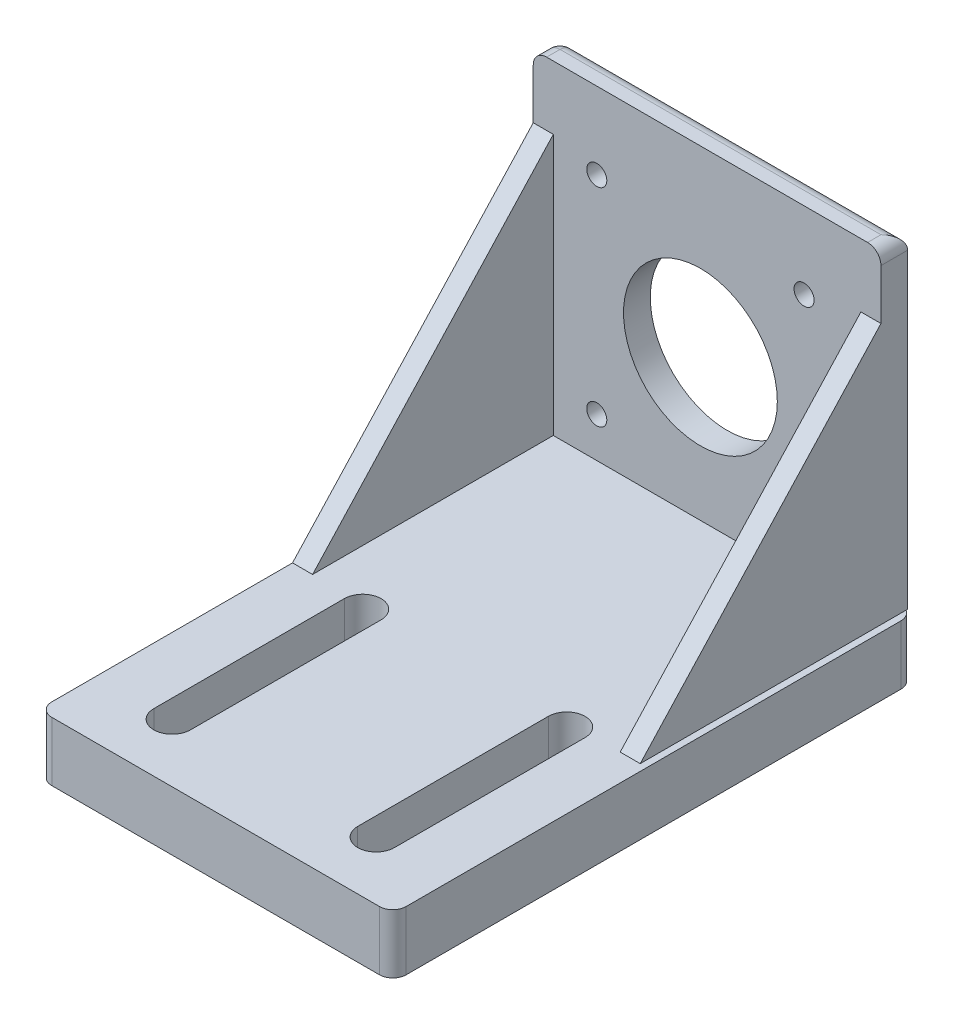
ISO-10303-21;
HEADER;
FILE_DESCRIPTION(('STEP AP214'),'2;1');
FILE_NAME('part.step','',(''),(''),'','','');
FILE_SCHEMA(('AUTOMOTIVE_DESIGN { 1 0 10303 214 1 1 1 1 }'));
ENDSEC;
DATA;
#1=APPLICATION_CONTEXT('core data for automotive mechanical design processes');
#2=APPLICATION_PROTOCOL_DEFINITION('international standard','automotive_design',2000,#1);
#3=PRODUCT_CONTEXT('',#1,'mechanical');
#4=PRODUCT('Part','Part','',(#3));
#5=PRODUCT_RELATED_PRODUCT_CATEGORY('part','',(#4));
#6=PRODUCT_DEFINITION_FORMATION('','',#4);
#7=PRODUCT_DEFINITION_CONTEXT('part definition',#1,'design');
#8=PRODUCT_DEFINITION('design','',#6,#7);
#9=PRODUCT_DEFINITION_SHAPE('','',#8);
#10=(LENGTH_UNIT() NAMED_UNIT(*) SI_UNIT(.MILLI.,.METRE.));
#11=(NAMED_UNIT(*) PLANE_ANGLE_UNIT() SI_UNIT($,.RADIAN.));
#12=(NAMED_UNIT(*) SI_UNIT($,.STERADIAN.) SOLID_ANGLE_UNIT());
#13=UNCERTAINTY_MEASURE_WITH_UNIT(LENGTH_MEASURE(1.E-05),#10,'distance_accuracy_value','');
#14=(GEOMETRIC_REPRESENTATION_CONTEXT(3) GLOBAL_UNCERTAINTY_ASSIGNED_CONTEXT((#13)) GLOBAL_UNIT_ASSIGNED_CONTEXT((#10,
#11,#12)) REPRESENTATION_CONTEXT('',''));
#15=CARTESIAN_POINT('',(0.,0.,0.));
#16=DIRECTION('',(0.,0.,1.));
#17=DIRECTION('',(1.,0.,0.));
#18=AXIS2_PLACEMENT_3D('',#15,#16,#17);
#19=CARTESIAN_POINT('',(0.,8.85,0.));
#20=DIRECTION('',(0.,-1.,0.));
#21=DIRECTION('',(0.,0.,-1.));
#22=AXIS2_PLACEMENT_3D('',#19,#20,#21);
#23=PLANE('',#22);
#24=DIRECTION('',(0.,0.,-1.));
#25=VECTOR('',#24,1.);
#26=CARTESIAN_POINT('',(2.49999999999999,8.85,16.75));
#27=LINE('',#26,#25);
#28=CARTESIAN_POINT('',(2.5,8.85,45.25));
#29=VERTEX_POINT('',#28);
#30=CARTESIAN_POINT('',(2.49999999999999,8.85,16.75));
#31=VERTEX_POINT('',#30);
#32=EDGE_CURVE('E264',#29,#31,#27,.T.);
#33=ORIENTED_EDGE('',*,*,#32,.F.);
#34=CARTESIAN_POINT('',(-0.249999999999997,8.85,45.25));
#35=DIRECTION('',(0.,1.,0.));
#36=DIRECTION('',(0.,0.,1.));
#37=AXIS2_PLACEMENT_3D('',#34,#35,#36);
#38=CIRCLE('',#37,2.75);
#39=CARTESIAN_POINT('',(-3.,8.85,45.2499999969299));
#40=VERTEX_POINT('',#39);
#41=EDGE_CURVE('E352',#40,#29,#38,.T.);
#42=ORIENTED_EDGE('',*,*,#41,.F.);
#43=DIRECTION('',(0.,0.,1.));
#44=VECTOR('',#43,1.);
#45=CARTESIAN_POINT('',(-3.,8.85,16.75));
#46=LINE('',#45,#44);
#47=CARTESIAN_POINT('',(-3.,8.85,16.75));
#48=VERTEX_POINT('',#47);
#49=EDGE_CURVE('E350',#48,#40,#46,.T.);
#50=ORIENTED_EDGE('',*,*,#49,.F.);
#51=CARTESIAN_POINT('',(-0.250000000000004,8.85,16.75));
#52=DIRECTION('',(0.,1.,0.));
#53=DIRECTION('',(0.,0.,1.));
#54=AXIS2_PLACEMENT_3D('',#51,#52,#53);
#55=CIRCLE('',#54,2.74999999999999);
#56=EDGE_CURVE('E348',#31,#48,#55,.T.);
#57=ORIENTED_EDGE('',*,*,#56,.F.);
#58=EDGE_LOOP('',(#33,#42,#50,#57));
#59=FACE_BOUND('',#58,.T.);
#60=DIRECTION('',(0.,0.,1.));
#61=VECTOR('',#60,1.);
#62=CARTESIAN_POINT('',(-33.5,8.85,16.75));
#63=LINE('',#62,#61);
#64=CARTESIAN_POINT('',(-33.5,8.85,16.75));
#65=VERTEX_POINT('',#64);
#66=CARTESIAN_POINT('',(-33.5,8.85,45.25));
#67=VERTEX_POINT('',#66);
#68=EDGE_CURVE('E355',#65,#67,#63,.T.);
#69=ORIENTED_EDGE('',*,*,#68,.F.);
#70=CARTESIAN_POINT('',(-30.75,8.85,16.75));
#71=DIRECTION('',(0.,1.,0.));
#72=DIRECTION('',(0.,0.,1.));
#73=AXIS2_PLACEMENT_3D('',#70,#71,#72);
#74=CIRCLE('',#73,2.74999999999999);
#75=CARTESIAN_POINT('',(-28.,8.85,16.75));
#76=VERTEX_POINT('',#75);
#77=EDGE_CURVE('E302',#76,#65,#74,.T.);
#78=ORIENTED_EDGE('',*,*,#77,.F.);
#79=DIRECTION('',(0.,0.,-1.));
#80=VECTOR('',#79,1.);
#81=CARTESIAN_POINT('',(-28.,8.85,16.75));
#82=LINE('',#81,#80);
#83=CARTESIAN_POINT('',(-28.,8.85,45.2499999969299));
#84=VERTEX_POINT('',#83);
#85=EDGE_CURVE('E359',#84,#76,#82,.T.);
#86=ORIENTED_EDGE('',*,*,#85,.F.);
#87=CARTESIAN_POINT('',(-30.75,8.85,45.25));
#88=DIRECTION('',(0.,1.,0.));
#89=DIRECTION('',(0.,0.,1.));
#90=AXIS2_PLACEMENT_3D('',#87,#88,#89);
#91=CIRCLE('',#90,2.75);
#92=EDGE_CURVE('E357',#67,#84,#91,.T.);
#93=ORIENTED_EDGE('',*,*,#92,.F.);
#94=EDGE_LOOP('',(#69,#78,#86,#93));
#95=FACE_BOUND('',#94,.T.);
#96=DIRECTION('',(0.,0.,-1.));
#97=VECTOR('',#96,1.);
#98=CARTESIAN_POINT('',(9.99999999999999,8.85,-20.));
#99=LINE('',#98,#97);
#100=CARTESIAN_POINT('',(9.99999999999999,8.85,16.));
#101=VERTEX_POINT('',#100);
#102=CARTESIAN_POINT('',(9.99999999999999,8.85,-23.7320508075689));
#103=VERTEX_POINT('',#102);
#104=EDGE_CURVE('E416',#101,#103,#99,.T.);
#105=ORIENTED_EDGE('',*,*,#104,.F.);
#106=DIRECTION('',(-1.,0.,0.));
#107=VECTOR('',#106,1.);
#108=CARTESIAN_POINT('',(0.,8.85,16.));
#109=LINE('',#108,#107);
#110=CARTESIAN_POINT('',(6.99999999999999,8.85,16.));
#111=VERTEX_POINT('',#110);
#112=EDGE_CURVE('E215',#101,#111,#109,.T.);
#113=ORIENTED_EDGE('',*,*,#112,.T.);
#114=DIRECTION('',(0.,0.,1.));
#115=VECTOR('',#114,1.);
#116=CARTESIAN_POINT('',(6.99999999999999,8.85,0.));
#117=LINE('',#116,#115);
#118=CARTESIAN_POINT('',(6.99999999999999,8.85,-20.));
#119=VERTEX_POINT('',#118);
#120=EDGE_CURVE('E404',#119,#111,#117,.T.);
#121=ORIENTED_EDGE('',*,*,#120,.F.);
#122=DIRECTION('',(1.,0.,0.));
#123=VECTOR('',#122,1.);
#124=CARTESIAN_POINT('',(-42.,8.85,-20.));
#125=LINE('',#124,#123);
#126=CARTESIAN_POINT('',(-39.,8.85,-20.));
#127=VERTEX_POINT('',#126);
#128=EDGE_CURVE('E390',#127,#119,#125,.T.);
#129=ORIENTED_EDGE('',*,*,#128,.F.);
#130=DIRECTION('',(0.,0.,-1.));
#131=VECTOR('',#130,1.);
#132=CARTESIAN_POINT('',(-39.,8.85,0.));
#133=LINE('',#132,#131);
#134=CARTESIAN_POINT('',(-39.,8.85,16.));
#135=VERTEX_POINT('',#134);
#136=EDGE_CURVE('E55',#135,#127,#133,.T.);
#137=ORIENTED_EDGE('',*,*,#136,.F.);
#138=DIRECTION('',(-1.,0.,0.));
#139=VECTOR('',#138,1.);
#140=CARTESIAN_POINT('',(0.,8.85,16.));
#141=LINE('',#140,#139);
#142=CARTESIAN_POINT('',(-42.,8.85,16.));
#143=VERTEX_POINT('',#142);
#144=EDGE_CURVE('E59',#135,#143,#141,.T.);
#145=ORIENTED_EDGE('',*,*,#144,.T.);
#146=DIRECTION('',(0.,0.,1.));
#147=VECTOR('',#146,1.);
#148=CARTESIAN_POINT('',(-42.,8.85,54.));
#149=LINE('',#148,#147);
#150=CARTESIAN_POINT('',(-42.,8.85,52.));
#151=VERTEX_POINT('',#150);
#152=EDGE_CURVE('E289',#143,#151,#149,.T.);
#153=ORIENTED_EDGE('',*,*,#152,.T.);
#154=CARTESIAN_POINT('',(-40.,8.85,52.));
#155=DIRECTION('',(0.,-1.,0.));
#156=DIRECTION('',(0.,0.,-1.));
#157=AXIS2_PLACEMENT_3D('',#154,#155,#156);
#158=CIRCLE('',#157,2.);
#159=CARTESIAN_POINT('',(-40.,8.85,54.));
#160=VERTEX_POINT('',#159);
#161=EDGE_CURVE('E328',#151,#160,#158,.F.);
#162=ORIENTED_EDGE('',*,*,#161,.T.);
#163=DIRECTION('',(1.,0.,0.));
#164=VECTOR('',#163,1.);
#165=CARTESIAN_POINT('',(-42.,8.85,54.));
#166=LINE('',#165,#164);
#167=CARTESIAN_POINT('',(8.99999999999999,8.85,54.));
#168=VERTEX_POINT('',#167);
#169=EDGE_CURVE('E291',#160,#168,#166,.T.);
#170=ORIENTED_EDGE('',*,*,#169,.T.);
#171=CARTESIAN_POINT('',(9.,8.85,52.));
#172=DIRECTION('',(0.,-1.,0.));
#173=DIRECTION('',(0.,0.,-1.));
#174=AXIS2_PLACEMENT_3D('',#171,#172,#173);
#175=CIRCLE('',#174,2.);
#176=CARTESIAN_POINT('',(11.,8.85,52.));
#177=VERTEX_POINT('',#176);
#178=EDGE_CURVE('E330',#168,#177,#175,.F.);
#179=ORIENTED_EDGE('',*,*,#178,.T.);
#180=DIRECTION('',(0.,0.,-1.));
#181=VECTOR('',#180,1.);
#182=CARTESIAN_POINT('',(11.,8.85,54.));
#183=LINE('',#182,#181);
#184=CARTESIAN_POINT('',(11.,8.85,-22.));
#185=VERTEX_POINT('',#184);
#186=EDGE_CURVE('E295',#177,#185,#183,.T.);
#187=ORIENTED_EDGE('',*,*,#186,.T.);
#188=CARTESIAN_POINT('',(8.99999999999999,8.85,-22.));
#189=DIRECTION('',(0.,-1.,0.));
#190=DIRECTION('',(0.,0.,-1.));
#191=AXIS2_PLACEMENT_3D('',#188,#189,#190);
#192=CIRCLE('',#191,2.);
#193=EDGE_CURVE('E333',#185,#103,#192,.F.);
#194=ORIENTED_EDGE('',*,*,#193,.T.);
#195=EDGE_LOOP('',(#105,#113,#121,#129,#137,#145,#153,#162,#170,#179,#187,#194));
#196=FACE_BOUND('',#195,.T.);
#197=ADVANCED_FACE('F40',(#59,#95,#196),#23,.F.);
#198=CARTESIAN_POINT('',(-42.,8.85,54.));
#199=DIRECTION('',(1.,0.,0.));
#200=DIRECTION('',(0.,0.,-1.));
#201=AXIS2_PLACEMENT_3D('',#198,#199,#200);
#202=PLANE('',#201);
#203=ORIENTED_EDGE('',*,*,#152,.F.);
#204=DIRECTION('',(0.,0.734803444627488,-0.678280102733066));
#205=VECTOR('',#204,1.);
#206=CARTESIAN_POINT('',(-42.,8.85000000000001,16.));
#207=LINE('',#206,#205);
#208=CARTESIAN_POINT('',(-42.,47.85,-20.));
#209=VERTEX_POINT('',#208);
#210=EDGE_CURVE('E403',#143,#209,#207,.T.);
#211=ORIENTED_EDGE('',*,*,#210,.T.);
#212=DIRECTION('',(0.,-1.,0.));
#213=VECTOR('',#212,1.);
#214=CARTESIAN_POINT('',(-42.,57.35,-20.));
#215=LINE('',#214,#213);
#216=CARTESIAN_POINT('',(-42.,55.35,-20.));
#217=VERTEX_POINT('',#216);
#218=EDGE_CURVE('E234',#217,#209,#215,.T.);
#219=ORIENTED_EDGE('',*,*,#218,.F.);
#220=DIRECTION('',(0.,0.,1.));
#221=VECTOR('',#220,1.);
#222=CARTESIAN_POINT('',(-42.,55.35,-22.));
#223=LINE('',#222,#221);
#224=CARTESIAN_POINT('',(-42.,55.35,-22.));
#225=VERTEX_POINT('',#224);
#226=EDGE_CURVE('E379',#217,#225,#223,.F.);
#227=ORIENTED_EDGE('',*,*,#226,.T.);
#228=DIRECTION('',(0.,-1.,0.));
#229=VECTOR('',#228,1.);
#230=CARTESIAN_POINT('',(-42.,8.85,-22.));
#231=LINE('',#230,#229);
#232=CARTESIAN_POINT('',(-42.,0.,-22.));
#233=VERTEX_POINT('',#232);
#234=EDGE_CURVE('E311',#225,#233,#231,.T.);
#235=ORIENTED_EDGE('',*,*,#234,.T.);
#236=DIRECTION('',(0.,0.,1.));
#237=VECTOR('',#236,1.);
#238=CARTESIAN_POINT('',(-42.,0.,54.));
#239=LINE('',#238,#237);
#240=CARTESIAN_POINT('',(-42.,0.,52.));
#241=VERTEX_POINT('',#240);
#242=EDGE_CURVE('E299',#233,#241,#239,.T.);
#243=ORIENTED_EDGE('',*,*,#242,.T.);
#244=DIRECTION('',(0.,-1.,0.));
#245=VECTOR('',#244,1.);
#246=CARTESIAN_POINT('',(-42.,8.85,52.));
#247=LINE('',#246,#245);
#248=EDGE_CURVE('E298',#241,#151,#247,.F.);
#249=ORIENTED_EDGE('',*,*,#248,.T.);
#250=EDGE_LOOP('',(#203,#211,#219,#227,#235,#243,#249));
#251=FACE_BOUND('',#250,.T.);
#252=ADVANCED_FACE('F455',(#251),#202,.F.);
#253=CARTESIAN_POINT('',(-42.,8.85,54.));
#254=DIRECTION('',(0.,0.,-1.));
#255=DIRECTION('',(-1.,0.,0.));
#256=AXIS2_PLACEMENT_3D('',#253,#254,#255);
#257=PLANE('',#256);
#258=DIRECTION('',(1.,0.,0.));
#259=VECTOR('',#258,1.);
#260=CARTESIAN_POINT('',(-42.,0.,54.));
#261=LINE('',#260,#259);
#262=CARTESIAN_POINT('',(-40.,0.,54.));
#263=VERTEX_POINT('',#262);
#264=CARTESIAN_POINT('',(8.99999999999999,0.,54.));
#265=VERTEX_POINT('',#264);
#266=EDGE_CURVE('E301',#263,#265,#261,.T.);
#267=ORIENTED_EDGE('',*,*,#266,.T.);
#268=DIRECTION('',(0.,-1.,0.));
#269=VECTOR('',#268,1.);
#270=CARTESIAN_POINT('',(8.99999999999999,8.85,54.));
#271=LINE('',#270,#269);
#272=EDGE_CURVE('E344',#265,#168,#271,.F.);
#273=ORIENTED_EDGE('',*,*,#272,.T.);
#274=ORIENTED_EDGE('',*,*,#169,.F.);
#275=DIRECTION('',(0.,-1.,0.));
#276=VECTOR('',#275,1.);
#277=CARTESIAN_POINT('',(-40.,8.85,54.));
#278=LINE('',#277,#276);
#279=EDGE_CURVE('E341',#160,#263,#278,.T.);
#280=ORIENTED_EDGE('',*,*,#279,.T.);
#281=EDGE_LOOP('',(#267,#273,#274,#280));
#282=FACE_BOUND('',#281,.T.);
#283=ADVANCED_FACE('F444',(#282),#257,.F.);
#284=CARTESIAN_POINT('',(11.,8.85,54.));
#285=DIRECTION('',(-1.,0.,0.));
#286=DIRECTION('',(0.,0.,1.));
#287=AXIS2_PLACEMENT_3D('',#284,#285,#286);
#288=PLANE('',#287);
#289=DIRECTION('',(0.,0.,-1.));
#290=VECTOR('',#289,1.);
#291=CARTESIAN_POINT('',(11.,0.,54.));
#292=LINE('',#291,#290);
#293=CARTESIAN_POINT('',(11.,0.,52.));
#294=VERTEX_POINT('',#293);
#295=CARTESIAN_POINT('',(11.,0.,-22.));
#296=VERTEX_POINT('',#295);
#297=EDGE_CURVE('E305',#294,#296,#292,.T.);
#298=ORIENTED_EDGE('',*,*,#297,.T.);
#299=DIRECTION('',(0.,-1.,0.));
#300=VECTOR('',#299,1.);
#301=CARTESIAN_POINT('',(11.,8.85,-22.));
#302=LINE('',#301,#300);
#303=EDGE_CURVE('E339',#296,#185,#302,.F.);
#304=ORIENTED_EDGE('',*,*,#303,.T.);
#305=ORIENTED_EDGE('',*,*,#186,.F.);
#306=DIRECTION('',(0.,-1.,0.));
#307=VECTOR('',#306,1.);
#308=CARTESIAN_POINT('',(11.,8.85,52.));
#309=LINE('',#308,#307);
#310=EDGE_CURVE('E336',#177,#294,#309,.T.);
#311=ORIENTED_EDGE('',*,*,#310,.T.);
#312=EDGE_LOOP('',(#298,#304,#305,#311));
#313=FACE_BOUND('',#312,.T.);
#314=ADVANCED_FACE('F434',(#313),#288,.F.);
#315=CARTESIAN_POINT('',(-42.,8.85,-24.));
#316=DIRECTION('',(0.,0.,1.));
#317=DIRECTION('',(1.,0.,0.));
#318=AXIS2_PLACEMENT_3D('',#315,#316,#317);
#319=PLANE('',#318);
#320=CARTESIAN_POINT('',(-1.5,45.85,-24.));
#321=DIRECTION('',(0.,0.,1.));
#322=DIRECTION('',(-1.,0.,0.));
#323=AXIS2_PLACEMENT_3D('',#320,#321,#322);
#324=CIRCLE('',#323,1.5);
#325=CARTESIAN_POINT('',(-3.00000000000001,45.85,-24.));
#326=VERTEX_POINT('',#325);
#327=EDGE_CURVE('E866',#326,#326,#324,.T.);
#328=ORIENTED_EDGE('',*,*,#327,.T.);
#329=EDGE_LOOP('',(#328));
#330=FACE_BOUND('',#329,.T.);
#331=CARTESIAN_POINT('',(-1.5,14.85,-24.));
#332=DIRECTION('',(0.,0.,1.));
#333=DIRECTION('',(-1.,0.,0.));
#334=AXIS2_PLACEMENT_3D('',#331,#332,#333);
#335=CIRCLE('',#334,1.5);
#336=CARTESIAN_POINT('',(-3.,14.85,-24.));
#337=VERTEX_POINT('',#336);
#338=EDGE_CURVE('E870',#337,#337,#335,.T.);
#339=ORIENTED_EDGE('',*,*,#338,.T.);
#340=EDGE_LOOP('',(#339));
#341=FACE_BOUND('',#340,.T.);
#342=CARTESIAN_POINT('',(-32.5,14.85,-24.));
#343=DIRECTION('',(0.,0.,1.));
#344=DIRECTION('',(1.,0.,0.));
#345=AXIS2_PLACEMENT_3D('',#342,#343,#344);
#346=CIRCLE('',#345,1.5);
#347=CARTESIAN_POINT('',(-31.,14.85,-24.));
#348=VERTEX_POINT('',#347);
#349=EDGE_CURVE('E900',#348,#348,#346,.T.);
#350=ORIENTED_EDGE('',*,*,#349,.T.);
#351=EDGE_LOOP('',(#350));
#352=FACE_BOUND('',#351,.T.);
#353=CARTESIAN_POINT('',(-32.5,45.85,-24.));
#354=DIRECTION('',(0.,0.,1.));
#355=DIRECTION('',(1.,0.,0.));
#356=AXIS2_PLACEMENT_3D('',#353,#354,#355);
#357=CIRCLE('',#356,1.5);
#358=CARTESIAN_POINT('',(-31.,45.85,-24.));
#359=VERTEX_POINT('',#358);
#360=EDGE_CURVE('E890',#359,#359,#357,.T.);
#361=ORIENTED_EDGE('',*,*,#360,.T.);
#362=EDGE_LOOP('',(#361));
#363=FACE_BOUND('',#362,.T.);
#364=CARTESIAN_POINT('',(-17.,30.,-24.));
#365=DIRECTION('',(0.,0.,1.));
#366=DIRECTION('',(1.,0.,0.));
#367=AXIS2_PLACEMENT_3D('',#364,#365,#366);
#368=CIRCLE('',#367,11.5);
#369=CARTESIAN_POINT('',(-5.5,30.,-24.));
#370=VERTEX_POINT('',#369);
#371=EDGE_CURVE('E878',#370,#370,#368,.T.);
#372=ORIENTED_EDGE('',*,*,#371,.T.);
#373=EDGE_LOOP('',(#372));
#374=FACE_BOUND('',#373,.T.);
#375=DIRECTION('',(0.,-1.,0.));
#376=VECTOR('',#375,1.);
#377=CARTESIAN_POINT('',(9.99999999999999,57.35,-24.));
#378=LINE('',#377,#376);
#379=CARTESIAN_POINT('',(9.99999999999999,55.35,-24.));
#380=VERTEX_POINT('',#379);
#381=CARTESIAN_POINT('',(9.99999999999999,8.85,-24.));
#382=VERTEX_POINT('',#381);
#383=EDGE_CURVE('E235',#380,#382,#378,.T.);
#384=ORIENTED_EDGE('',*,*,#383,.T.);
#385=DIRECTION('',(-1.,0.,0.));
#386=VECTOR('',#385,1.);
#387=CARTESIAN_POINT('',(-40.,8.85,-24.));
#388=LINE('',#387,#386);
#389=CARTESIAN_POINT('',(8.99999999999999,8.85,-24.));
#390=VERTEX_POINT('',#389);
#391=EDGE_CURVE('E413',#382,#390,#388,.T.);
#392=ORIENTED_EDGE('',*,*,#391,.T.);
#393=DIRECTION('',(0.,-1.,0.));
#394=VECTOR('',#393,1.);
#395=CARTESIAN_POINT('',(8.99999999999999,8.85,-24.));
#396=LINE('',#395,#394);
#397=CARTESIAN_POINT('',(8.99999999999999,0.,-24.));
#398=VERTEX_POINT('',#397);
#399=EDGE_CURVE('E323',#390,#398,#396,.T.);
#400=ORIENTED_EDGE('',*,*,#399,.T.);
#401=DIRECTION('',(-1.,0.,0.));
#402=VECTOR('',#401,1.);
#403=CARTESIAN_POINT('',(-42.,0.,-24.));
#404=LINE('',#403,#402);
#405=CARTESIAN_POINT('',(-40.,0.,-24.));
#406=VERTEX_POINT('',#405);
#407=EDGE_CURVE('E292',#398,#406,#404,.T.);
#408=ORIENTED_EDGE('',*,*,#407,.T.);
#409=DIRECTION('',(0.,-1.,0.));
#410=VECTOR('',#409,1.);
#411=CARTESIAN_POINT('',(-40.,8.85,-24.));
#412=LINE('',#411,#410);
#413=CARTESIAN_POINT('',(-40.,55.35,-24.));
#414=VERTEX_POINT('',#413);
#415=EDGE_CURVE('E326',#406,#414,#412,.F.);
#416=ORIENTED_EDGE('',*,*,#415,.T.);
#417=DIRECTION('',(-1.,0.,0.));
#418=VECTOR('',#417,1.);
#419=CARTESIAN_POINT('',(9.99999999999999,55.35,-24.));
#420=LINE('',#419,#418);
#421=EDGE_CURVE('E369',#414,#380,#420,.F.);
#422=ORIENTED_EDGE('',*,*,#421,.T.);
#423=EDGE_LOOP('',(#384,#392,#400,#408,#416,#422));
#424=FACE_BOUND('',#423,.T.);
#425=ADVANCED_FACE('F420',(#330,#341,#352,#363,#374,#424),#319,.F.);
#426=CARTESIAN_POINT('',(0.,0.,0.));
#427=DIRECTION('',(0.,-1.,0.));
#428=DIRECTION('',(0.,0.,-1.));
#429=AXIS2_PLACEMENT_3D('',#426,#427,#428);
#430=PLANE('',#429);
#431=CARTESIAN_POINT('',(8.99999999999999,0.,-22.));
#432=DIRECTION('',(0.,-1.,0.));
#433=DIRECTION('',(0.,0.,-1.));
#434=AXIS2_PLACEMENT_3D('',#431,#432,#433);
#435=CIRCLE('',#434,2.);
#436=EDGE_CURVE('E318',#398,#296,#435,.T.);
#437=ORIENTED_EDGE('',*,*,#436,.T.);
#438=ORIENTED_EDGE('',*,*,#297,.F.);
#439=CARTESIAN_POINT('',(9.,0.,52.));
#440=DIRECTION('',(0.,-1.,0.));
#441=DIRECTION('',(0.,0.,-1.));
#442=AXIS2_PLACEMENT_3D('',#439,#440,#441);
#443=CIRCLE('',#442,2.);
#444=EDGE_CURVE('E316',#294,#265,#443,.T.);
#445=ORIENTED_EDGE('',*,*,#444,.T.);
#446=ORIENTED_EDGE('',*,*,#266,.F.);
#447=CARTESIAN_POINT('',(-40.,0.,52.));
#448=DIRECTION('',(0.,-1.,0.));
#449=DIRECTION('',(0.,0.,-1.));
#450=AXIS2_PLACEMENT_3D('',#447,#448,#449);
#451=CIRCLE('',#450,2.);
#452=EDGE_CURVE('E313',#263,#241,#451,.T.);
#453=ORIENTED_EDGE('',*,*,#452,.T.);
#454=ORIENTED_EDGE('',*,*,#242,.F.);
#455=CARTESIAN_POINT('',(-40.,0.,-22.));
#456=DIRECTION('',(0.,-1.,0.));
#457=DIRECTION('',(0.,0.,-1.));
#458=AXIS2_PLACEMENT_3D('',#455,#456,#457);
#459=CIRCLE('',#458,2.);
#460=EDGE_CURVE('E320',#233,#406,#459,.T.);
#461=ORIENTED_EDGE('',*,*,#460,.T.);
#462=ORIENTED_EDGE('',*,*,#407,.F.);
#463=EDGE_LOOP('',(#437,#438,#445,#446,#453,#454,#461,#462));
#464=FACE_BOUND('',#463,.T.);
#465=CARTESIAN_POINT('',(-30.75,0.,16.75));
#466=DIRECTION('',(0.,1.,0.));
#467=DIRECTION('',(0.,0.,1.));
#468=AXIS2_PLACEMENT_3D('',#465,#466,#467);
#469=CIRCLE('',#468,2.74999999999999);
#470=CARTESIAN_POINT('',(-28.,0.,16.75));
#471=VERTEX_POINT('',#470);
#472=CARTESIAN_POINT('',(-33.5,0.,16.75));
#473=VERTEX_POINT('',#472);
#474=EDGE_CURVE('E243',#471,#473,#469,.T.);
#475=ORIENTED_EDGE('',*,*,#474,.T.);
#476=DIRECTION('',(0.,0.,1.));
#477=VECTOR('',#476,1.);
#478=CARTESIAN_POINT('',(-33.5,0.,16.75));
#479=LINE('',#478,#477);
#480=CARTESIAN_POINT('',(-33.5,0.,45.25));
#481=VERTEX_POINT('',#480);
#482=EDGE_CURVE('E246',#473,#481,#479,.T.);
#483=ORIENTED_EDGE('',*,*,#482,.T.);
#484=CARTESIAN_POINT('',(-30.75,0.,45.25));
#485=DIRECTION('',(0.,1.,0.));
#486=DIRECTION('',(0.,0.,1.));
#487=AXIS2_PLACEMENT_3D('',#484,#485,#486);
#488=CIRCLE('',#487,2.75);
#489=CARTESIAN_POINT('',(-28.,0.,45.2499999938597));
#490=VERTEX_POINT('',#489);
#491=EDGE_CURVE('E250',#481,#490,#488,.T.);
#492=ORIENTED_EDGE('',*,*,#491,.T.);
#493=DIRECTION('',(0.,0.,-1.));
#494=VECTOR('',#493,1.);
#495=CARTESIAN_POINT('',(-28.,0.,16.75));
#496=LINE('',#495,#494);
#497=EDGE_CURVE('E253',#490,#471,#496,.T.);
#498=ORIENTED_EDGE('',*,*,#497,.T.);
#499=EDGE_LOOP('',(#475,#483,#492,#498));
#500=FACE_BOUND('',#499,.T.);
#501=CARTESIAN_POINT('',(-0.249999999999997,0.,45.25));
#502=DIRECTION('',(0.,1.,0.));
#503=DIRECTION('',(0.,0.,-1.));
#504=AXIS2_PLACEMENT_3D('',#501,#502,#503);
#505=CIRCLE('',#504,2.75);
#506=CARTESIAN_POINT('',(-3.,0.,45.2499999938597));
#507=VERTEX_POINT('',#506);
#508=CARTESIAN_POINT('',(2.5,0.,45.25));
#509=VERTEX_POINT('',#508);
#510=EDGE_CURVE('E247',#507,#509,#505,.T.);
#511=ORIENTED_EDGE('',*,*,#510,.T.);
#512=DIRECTION('',(0.,0.,-1.));
#513=VECTOR('',#512,1.);
#514=CARTESIAN_POINT('',(2.49999999999999,0.,16.75));
#515=LINE('',#514,#513);
#516=CARTESIAN_POINT('',(2.49999999999999,0.,16.75));
#517=VERTEX_POINT('',#516);
#518=EDGE_CURVE('E284',#509,#517,#515,.T.);
#519=ORIENTED_EDGE('',*,*,#518,.T.);
#520=CARTESIAN_POINT('',(-0.250000000000004,0.,16.75));
#521=DIRECTION('',(0.,1.,0.));
#522=DIRECTION('',(0.,0.,-1.));
#523=AXIS2_PLACEMENT_3D('',#520,#521,#522);
#524=CIRCLE('',#523,2.74999999999999);
#525=CARTESIAN_POINT('',(-3.,0.,16.75));
#526=VERTEX_POINT('',#525);
#527=EDGE_CURVE('E281',#517,#526,#524,.T.);
#528=ORIENTED_EDGE('',*,*,#527,.T.);
#529=DIRECTION('',(0.,0.,1.));
#530=VECTOR('',#529,1.);
#531=CARTESIAN_POINT('',(-3.,0.,16.75));
#532=LINE('',#531,#530);
#533=EDGE_CURVE('E274',#526,#507,#532,.T.);
#534=ORIENTED_EDGE('',*,*,#533,.T.);
#535=EDGE_LOOP('',(#511,#519,#528,#534));
#536=FACE_BOUND('',#535,.T.);
#537=ADVANCED_FACE('F441',(#464,#500,#536),#430,.T.);
#538=CARTESIAN_POINT('',(-40.,8.85,-22.));
#539=DIRECTION('',(0.,-1.,0.));
#540=DIRECTION('',(0.,0.,-1.));
#541=AXIS2_PLACEMENT_3D('',#538,#539,#540);
#542=CYLINDRICAL_SURFACE('',#541,2.);
#543=CARTESIAN_POINT('',(-40.,55.35,-22.));
#544=DIRECTION('',(0.,-1.,0.));
#545=DIRECTION('',(0.,0.,-1.));
#546=AXIS2_PLACEMENT_3D('',#543,#544,#545);
#547=CIRCLE('',#546,2.);
#548=EDGE_CURVE('E371',#225,#414,#547,.T.);
#549=ORIENTED_EDGE('',*,*,#548,.T.);
#550=ORIENTED_EDGE('',*,*,#415,.F.);
#551=ORIENTED_EDGE('',*,*,#460,.F.);
#552=ORIENTED_EDGE('',*,*,#234,.F.);
#553=EDGE_LOOP('',(#549,#550,#551,#552));
#554=FACE_BOUND('',#553,.T.);
#555=ADVANCED_FACE('F460',(#554),#542,.T.);
#556=CARTESIAN_POINT('',(8.99999999999999,8.85,-22.));
#557=DIRECTION('',(0.,-1.,0.));
#558=DIRECTION('',(0.,0.,-1.));
#559=AXIS2_PLACEMENT_3D('',#556,#557,#558);
#560=CYLINDRICAL_SURFACE('',#559,2.);
#561=ORIENTED_EDGE('',*,*,#303,.F.);
#562=ORIENTED_EDGE('',*,*,#436,.F.);
#563=ORIENTED_EDGE('',*,*,#399,.F.);
#564=EDGE_CURVE('E332',#103,#390,#192,.F.);
#565=ORIENTED_EDGE('',*,*,#564,.F.);
#566=ORIENTED_EDGE('',*,*,#193,.F.);
#567=EDGE_LOOP('',(#561,#562,#563,#565,#566));
#568=FACE_BOUND('',#567,.T.);
#569=ADVANCED_FACE('F429',(#568),#560,.T.);
#570=CARTESIAN_POINT('',(9.,8.85,52.));
#571=DIRECTION('',(0.,-1.,0.));
#572=DIRECTION('',(0.,0.,-1.));
#573=AXIS2_PLACEMENT_3D('',#570,#571,#572);
#574=CYLINDRICAL_SURFACE('',#573,2.);
#575=ORIENTED_EDGE('',*,*,#178,.F.);
#576=ORIENTED_EDGE('',*,*,#272,.F.);
#577=ORIENTED_EDGE('',*,*,#444,.F.);
#578=ORIENTED_EDGE('',*,*,#310,.F.);
#579=EDGE_LOOP('',(#575,#576,#577,#578));
#580=FACE_BOUND('',#579,.T.);
#581=ADVANCED_FACE('F437',(#580),#574,.T.);
#582=CARTESIAN_POINT('',(-40.,8.85,52.));
#583=DIRECTION('',(0.,-1.,0.));
#584=DIRECTION('',(0.,0.,-1.));
#585=AXIS2_PLACEMENT_3D('',#582,#583,#584);
#586=CYLINDRICAL_SURFACE('',#585,2.);
#587=ORIENTED_EDGE('',*,*,#161,.F.);
#588=ORIENTED_EDGE('',*,*,#248,.F.);
#589=ORIENTED_EDGE('',*,*,#452,.F.);
#590=ORIENTED_EDGE('',*,*,#279,.F.);
#591=EDGE_LOOP('',(#587,#588,#589,#590));
#592=FACE_BOUND('',#591,.T.);
#593=ADVANCED_FACE('F449',(#592),#586,.T.);
#594=CARTESIAN_POINT('',(-0.249999999999997,0.,45.25));
#595=DIRECTION('',(0.,1.,0.));
#596=DIRECTION('',(0.,0.,1.));
#597=AXIS2_PLACEMENT_3D('',#594,#595,#596);
#598=CYLINDRICAL_SURFACE('',#597,2.75);
#599=DIRECTION('',(0.,1.,0.));
#600=VECTOR('',#599,1.);
#601=CARTESIAN_POINT('',(2.5,0.,45.25));
#602=LINE('',#601,#600);
#603=EDGE_CURVE('E271',#509,#29,#602,.T.);
#604=ORIENTED_EDGE('',*,*,#603,.F.);
#605=ORIENTED_EDGE('',*,*,#510,.F.);
#606=DIRECTION('',(0.,1.,0.));
#607=VECTOR('',#606,1.);
#608=CARTESIAN_POINT('',(-3.,0.,45.2499999938597));
#609=LINE('',#608,#607);
#610=EDGE_CURVE('E237',#507,#40,#609,.T.);
#611=ORIENTED_EDGE('',*,*,#610,.T.);
#612=ORIENTED_EDGE('',*,*,#41,.T.);
#613=EDGE_LOOP('',(#604,#605,#611,#612));
#614=FACE_BOUND('',#613,.T.);
#615=ADVANCED_FACE('F515',(#614),#598,.F.);
#616=CARTESIAN_POINT('',(-3.,0.,16.75));
#617=DIRECTION('',(-1.,0.,0.));
#618=DIRECTION('',(0.,0.,1.));
#619=AXIS2_PLACEMENT_3D('',#616,#617,#618);
#620=PLANE('',#619);
#621=ORIENTED_EDGE('',*,*,#610,.F.);
#622=ORIENTED_EDGE('',*,*,#533,.F.);
#623=DIRECTION('',(0.,1.,0.));
#624=VECTOR('',#623,1.);
#625=CARTESIAN_POINT('',(-3.,0.,16.75));
#626=LINE('',#625,#624);
#627=EDGE_CURVE('E272',#526,#48,#626,.T.);
#628=ORIENTED_EDGE('',*,*,#627,.T.);
#629=ORIENTED_EDGE('',*,*,#49,.T.);
#630=EDGE_LOOP('',(#621,#622,#628,#629));
#631=FACE_BOUND('',#630,.T.);
#632=ADVANCED_FACE('F497',(#631),#620,.F.);
#633=CARTESIAN_POINT('',(-0.250000000000004,0.,16.75));
#634=DIRECTION('',(0.,1.,0.));
#635=DIRECTION('',(0.,0.,1.));
#636=AXIS2_PLACEMENT_3D('',#633,#634,#635);
#637=CYLINDRICAL_SURFACE('',#636,2.74999999999999);
#638=ORIENTED_EDGE('',*,*,#627,.F.);
#639=ORIENTED_EDGE('',*,*,#527,.F.);
#640=DIRECTION('',(0.,1.,0.));
#641=VECTOR('',#640,1.);
#642=CARTESIAN_POINT('',(2.49999999999999,0.,16.75));
#643=LINE('',#642,#641);
#644=EDGE_CURVE('E268',#517,#31,#643,.T.);
#645=ORIENTED_EDGE('',*,*,#644,.T.);
#646=ORIENTED_EDGE('',*,*,#56,.T.);
#647=EDGE_LOOP('',(#638,#639,#645,#646));
#648=FACE_BOUND('',#647,.T.);
#649=ADVANCED_FACE('F524',(#648),#637,.F.);
#650=CARTESIAN_POINT('',(2.49999999999999,0.,16.75));
#651=DIRECTION('',(1.,0.,0.));
#652=DIRECTION('',(0.,0.,-1.));
#653=AXIS2_PLACEMENT_3D('',#650,#651,#652);
#654=PLANE('',#653);
#655=ORIENTED_EDGE('',*,*,#644,.F.);
#656=ORIENTED_EDGE('',*,*,#518,.F.);
#657=ORIENTED_EDGE('',*,*,#603,.T.);
#658=ORIENTED_EDGE('',*,*,#32,.T.);
#659=EDGE_LOOP('',(#655,#656,#657,#658));
#660=FACE_BOUND('',#659,.T.);
#661=ADVANCED_FACE('F530',(#660),#654,.F.);
#662=CARTESIAN_POINT('',(-30.75,0.,16.75));
#663=DIRECTION('',(0.,1.,0.));
#664=DIRECTION('',(0.,0.,1.));
#665=AXIS2_PLACEMENT_3D('',#662,#663,#664);
#666=CYLINDRICAL_SURFACE('',#665,2.74999999999999);
#667=DIRECTION('',(0.,1.,0.));
#668=VECTOR('',#667,1.);
#669=CARTESIAN_POINT('',(-33.5,0.,16.75));
#670=LINE('',#669,#668);
#671=EDGE_CURVE('E256',#473,#65,#670,.T.);
#672=ORIENTED_EDGE('',*,*,#671,.F.);
#673=ORIENTED_EDGE('',*,*,#474,.F.);
#674=DIRECTION('',(0.,1.,0.));
#675=VECTOR('',#674,1.);
#676=CARTESIAN_POINT('',(-28.,0.,16.75));
#677=LINE('',#676,#675);
#678=EDGE_CURVE('E260',#471,#76,#677,.T.);
#679=ORIENTED_EDGE('',*,*,#678,.T.);
#680=ORIENTED_EDGE('',*,*,#77,.T.);
#681=EDGE_LOOP('',(#672,#673,#679,#680));
#682=FACE_BOUND('',#681,.T.);
#683=ADVANCED_FACE('F528',(#682),#666,.F.);
#684=CARTESIAN_POINT('',(-28.,0.,16.75));
#685=DIRECTION('',(1.,0.,0.));
#686=DIRECTION('',(0.,0.,-1.));
#687=AXIS2_PLACEMENT_3D('',#684,#685,#686);
#688=PLANE('',#687);
#689=ORIENTED_EDGE('',*,*,#678,.F.);
#690=ORIENTED_EDGE('',*,*,#497,.F.);
#691=DIRECTION('',(0.,1.,0.));
#692=VECTOR('',#691,1.);
#693=CARTESIAN_POINT('',(-28.,0.,45.2499999938597));
#694=LINE('',#693,#692);
#695=EDGE_CURVE('E257',#490,#84,#694,.T.);
#696=ORIENTED_EDGE('',*,*,#695,.T.);
#697=ORIENTED_EDGE('',*,*,#85,.T.);
#698=EDGE_LOOP('',(#689,#690,#696,#697));
#699=FACE_BOUND('',#698,.T.);
#700=ADVANCED_FACE('F557',(#699),#688,.F.);
#701=CARTESIAN_POINT('',(-30.75,0.,45.25));
#702=DIRECTION('',(0.,1.,0.));
#703=DIRECTION('',(0.,0.,1.));
#704=AXIS2_PLACEMENT_3D('',#701,#702,#703);
#705=CYLINDRICAL_SURFACE('',#704,2.75);
#706=ORIENTED_EDGE('',*,*,#695,.F.);
#707=ORIENTED_EDGE('',*,*,#491,.F.);
#708=DIRECTION('',(0.,1.,0.));
#709=VECTOR('',#708,1.);
#710=CARTESIAN_POINT('',(-33.5,0.,45.25));
#711=LINE('',#710,#709);
#712=EDGE_CURVE('E261',#481,#67,#711,.T.);
#713=ORIENTED_EDGE('',*,*,#712,.T.);
#714=ORIENTED_EDGE('',*,*,#92,.T.);
#715=EDGE_LOOP('',(#706,#707,#713,#714));
#716=FACE_BOUND('',#715,.T.);
#717=ADVANCED_FACE('F564',(#716),#705,.F.);
#718=CARTESIAN_POINT('',(-33.5,0.,16.75));
#719=DIRECTION('',(-1.,0.,0.));
#720=DIRECTION('',(0.,0.,1.));
#721=AXIS2_PLACEMENT_3D('',#718,#719,#720);
#722=PLANE('',#721);
#723=ORIENTED_EDGE('',*,*,#712,.F.);
#724=ORIENTED_EDGE('',*,*,#482,.F.);
#725=ORIENTED_EDGE('',*,*,#671,.T.);
#726=ORIENTED_EDGE('',*,*,#68,.T.);
#727=EDGE_LOOP('',(#723,#724,#725,#726));
#728=FACE_BOUND('',#727,.T.);
#729=ADVANCED_FACE('F572',(#728),#722,.F.);
#730=CARTESIAN_POINT('',(-40.,8.85,-22.));
#731=DIRECTION('',(0.,1.,0.));
#732=DIRECTION('',(0.,0.,1.));
#733=AXIS2_PLACEMENT_3D('',#730,#731,#732);
#734=PLANE('',#733);
#735=EDGE_CURVE('E415',#103,#382,#99,.T.);
#736=ORIENTED_EDGE('',*,*,#735,.F.);
#737=ORIENTED_EDGE('',*,*,#564,.T.);
#738=ORIENTED_EDGE('',*,*,#391,.F.);
#739=EDGE_LOOP('',(#736,#737,#738));
#740=FACE_BOUND('',#739,.T.);
#741=ADVANCED_FACE('F425',(#740),#734,.F.);
#742=CARTESIAN_POINT('',(-42.,57.35,-20.));
#743=DIRECTION('',(0.,0.,-1.));
#744=DIRECTION('',(-1.,0.,0.));
#745=AXIS2_PLACEMENT_3D('',#742,#743,#744);
#746=PLANE('',#745);
#747=CARTESIAN_POINT('',(-1.5,45.85,-20.));
#748=DIRECTION('',(0.,0.,1.));
#749=DIRECTION('',(-1.,0.,0.));
#750=AXIS2_PLACEMENT_3D('',#747,#748,#749);
#751=CIRCLE('',#750,1.5);
#752=CARTESIAN_POINT('',(-3.00000000000001,45.85,-20.));
#753=VERTEX_POINT('',#752);
#754=EDGE_CURVE('E869',#753,#753,#751,.T.);
#755=ORIENTED_EDGE('',*,*,#754,.F.);
#756=EDGE_LOOP('',(#755));
#757=FACE_BOUND('',#756,.T.);
#758=CARTESIAN_POINT('',(-1.5,14.85,-20.));
#759=DIRECTION('',(0.,0.,1.));
#760=DIRECTION('',(-1.,0.,0.));
#761=AXIS2_PLACEMENT_3D('',#758,#759,#760);
#762=CIRCLE('',#761,1.5);
#763=CARTESIAN_POINT('',(-3.,14.85,-20.));
#764=VERTEX_POINT('',#763);
#765=EDGE_CURVE('E873',#764,#764,#762,.T.);
#766=ORIENTED_EDGE('',*,*,#765,.F.);
#767=EDGE_LOOP('',(#766));
#768=FACE_BOUND('',#767,.T.);
#769=CARTESIAN_POINT('',(-32.5,14.85,-20.));
#770=DIRECTION('',(0.,0.,1.));
#771=DIRECTION('',(1.,0.,0.));
#772=AXIS2_PLACEMENT_3D('',#769,#770,#771);
#773=CIRCLE('',#772,1.5);
#774=CARTESIAN_POINT('',(-31.,14.85,-20.));
#775=VERTEX_POINT('',#774);
#776=EDGE_CURVE('E895',#775,#775,#773,.T.);
#777=ORIENTED_EDGE('',*,*,#776,.F.);
#778=EDGE_LOOP('',(#777));
#779=FACE_BOUND('',#778,.T.);
#780=CARTESIAN_POINT('',(-32.5,45.85,-20.));
#781=DIRECTION('',(0.,0.,1.));
#782=DIRECTION('',(1.,0.,0.));
#783=AXIS2_PLACEMENT_3D('',#780,#781,#782);
#784=CIRCLE('',#783,1.5);
#785=CARTESIAN_POINT('',(-31.,45.85,-20.));
#786=VERTEX_POINT('',#785);
#787=EDGE_CURVE('E883',#786,#786,#784,.T.);
#788=ORIENTED_EDGE('',*,*,#787,.F.);
#789=EDGE_LOOP('',(#788));
#790=FACE_BOUND('',#789,.T.);
#791=CARTESIAN_POINT('',(-17.,30.,-20.));
#792=DIRECTION('',(0.,0.,1.));
#793=DIRECTION('',(1.,0.,0.));
#794=AXIS2_PLACEMENT_3D('',#791,#792,#793);
#795=CIRCLE('',#794,11.5);
#796=CARTESIAN_POINT('',(-5.5,30.,-20.));
#797=VERTEX_POINT('',#796);
#798=EDGE_CURVE('E881',#797,#797,#795,.T.);
#799=ORIENTED_EDGE('',*,*,#798,.F.);
#800=EDGE_LOOP('',(#799));
#801=FACE_BOUND('',#800,.T.);
#802=DIRECTION('',(0.,-1.,0.));
#803=VECTOR('',#802,1.);
#804=CARTESIAN_POINT('',(6.99999999999999,57.35,-20.));
#805=LINE('',#804,#803);
#806=CARTESIAN_POINT('',(6.99999999999999,47.85,-20.));
#807=VERTEX_POINT('',#806);
#808=EDGE_CURVE('E11',#807,#119,#805,.T.);
#809=ORIENTED_EDGE('',*,*,#808,.F.);
#810=DIRECTION('',(1.,0.,0.));
#811=VECTOR('',#810,1.);
#812=CARTESIAN_POINT('',(-42.,47.85,-20.));
#813=LINE('',#812,#811);
#814=CARTESIAN_POINT('',(9.99999999999999,47.85,-20.));
#815=VERTEX_POINT('',#814);
#816=EDGE_CURVE('E212',#807,#815,#813,.T.);
#817=ORIENTED_EDGE('',*,*,#816,.T.);
#818=DIRECTION('',(0.,-1.,0.));
#819=VECTOR('',#818,1.);
#820=CARTESIAN_POINT('',(9.99999999999999,57.35,-20.));
#821=LINE('',#820,#819);
#822=CARTESIAN_POINT('',(9.99999999999999,55.35,-20.));
#823=VERTEX_POINT('',#822);
#824=EDGE_CURVE('E225',#823,#815,#821,.T.);
#825=ORIENTED_EDGE('',*,*,#824,.F.);
#826=CARTESIAN_POINT('',(7.99999999999999,55.35,-20.));
#827=DIRECTION('',(0.,0.,-1.));
#828=DIRECTION('',(-1.,0.,0.));
#829=AXIS2_PLACEMENT_3D('',#826,#827,#828);
#830=CIRCLE('',#829,2.);
#831=CARTESIAN_POINT('',(7.99999999999998,57.35,-20.));
#832=VERTEX_POINT('',#831);
#833=EDGE_CURVE('E377',#823,#832,#830,.F.);
#834=ORIENTED_EDGE('',*,*,#833,.T.);
#835=DIRECTION('',(1.,0.,0.));
#836=VECTOR('',#835,1.);
#837=CARTESIAN_POINT('',(-42.,57.35,-20.));
#838=LINE('',#837,#836);
#839=CARTESIAN_POINT('',(-40.,57.35,-20.));
#840=VERTEX_POINT('',#839);
#841=EDGE_CURVE('E239',#840,#832,#838,.T.);
#842=ORIENTED_EDGE('',*,*,#841,.F.);
#843=CARTESIAN_POINT('',(-40.,55.35,-20.));
#844=DIRECTION('',(0.,0.,-1.));
#845=DIRECTION('',(-1.,0.,0.));
#846=AXIS2_PLACEMENT_3D('',#843,#844,#845);
#847=CIRCLE('',#846,2.);
#848=EDGE_CURVE('E375',#840,#217,#847,.F.);
#849=ORIENTED_EDGE('',*,*,#848,.T.);
#850=ORIENTED_EDGE('',*,*,#218,.T.);
#851=DIRECTION('',(1.,0.,0.));
#852=VECTOR('',#851,1.);
#853=CARTESIAN_POINT('',(-42.,47.85,-20.));
#854=LINE('',#853,#852);
#855=CARTESIAN_POINT('',(-39.,47.85,-20.));
#856=VERTEX_POINT('',#855);
#857=EDGE_CURVE('E48',#209,#856,#854,.T.);
#858=ORIENTED_EDGE('',*,*,#857,.T.);
#859=DIRECTION('',(0.,1.,0.));
#860=VECTOR('',#859,1.);
#861=CARTESIAN_POINT('',(-39.,57.35,-20.));
#862=LINE('',#861,#860);
#863=EDGE_CURVE('E381',#127,#856,#862,.T.);
#864=ORIENTED_EDGE('',*,*,#863,.F.);
#865=ORIENTED_EDGE('',*,*,#128,.T.);
#866=EDGE_LOOP('',(#809,#817,#825,#834,#842,#849,#850,#858,#864,#865));
#867=FACE_BOUND('',#866,.T.);
#868=ADVANCED_FACE('F224',(#757,#768,#779,#790,#801,#867),#746,.F.);
#869=CARTESIAN_POINT('',(9.99999999999999,57.35,-20.));
#870=DIRECTION('',(-1.,0.,0.));
#871=DIRECTION('',(0.,0.,1.));
#872=AXIS2_PLACEMENT_3D('',#869,#870,#871);
#873=PLANE('',#872);
#874=ORIENTED_EDGE('',*,*,#735,.T.);
#875=ORIENTED_EDGE('',*,*,#383,.F.);
#876=DIRECTION('',(0.,0.,-1.));
#877=VECTOR('',#876,1.);
#878=CARTESIAN_POINT('',(9.99999999999999,55.35,-20.));
#879=LINE('',#878,#877);
#880=EDGE_CURVE('E233',#380,#823,#879,.F.);
#881=ORIENTED_EDGE('',*,*,#880,.T.);
#882=ORIENTED_EDGE('',*,*,#824,.T.);
#883=DIRECTION('',(0.,-0.734803444627488,0.678280102733066));
#884=VECTOR('',#883,1.);
#885=CARTESIAN_POINT('',(9.99999999999999,47.85,-20.));
#886=LINE('',#885,#884);
#887=EDGE_CURVE('E208',#815,#101,#886,.T.);
#888=ORIENTED_EDGE('',*,*,#887,.T.);
#889=ORIENTED_EDGE('',*,*,#104,.T.);
#890=EDGE_LOOP('',(#874,#875,#881,#882,#888,#889));
#891=FACE_BOUND('',#890,.T.);
#892=ADVANCED_FACE('F230',(#891),#873,.F.);
#893=CARTESIAN_POINT('',(-40.,57.35,-22.));
#894=DIRECTION('',(0.,1.,0.));
#895=DIRECTION('',(0.,0.,1.));
#896=AXIS2_PLACEMENT_3D('',#893,#894,#895);
#897=PLANE('',#896);
#898=ORIENTED_EDGE('',*,*,#841,.T.);
#899=DIRECTION('',(0.,0.,-1.));
#900=VECTOR('',#899,1.);
#901=CARTESIAN_POINT('',(7.99999999999999,57.35,-24.));
#902=LINE('',#901,#900);
#903=CARTESIAN_POINT('',(7.99999999999999,57.35,-22.));
#904=VERTEX_POINT('',#903);
#905=EDGE_CURVE('E367',#832,#904,#902,.T.);
#906=ORIENTED_EDGE('',*,*,#905,.T.);
#907=DIRECTION('',(-1.,0.,0.));
#908=VECTOR('',#907,1.);
#909=CARTESIAN_POINT('',(-40.,57.35,-22.));
#910=LINE('',#909,#908);
#911=CARTESIAN_POINT('',(-40.,57.35,-22.));
#912=VERTEX_POINT('',#911);
#913=EDGE_CURVE('E364',#904,#912,#910,.T.);
#914=ORIENTED_EDGE('',*,*,#913,.T.);
#915=DIRECTION('',(0.,0.,1.));
#916=VECTOR('',#915,1.);
#917=CARTESIAN_POINT('',(-40.,57.35,-20.));
#918=LINE('',#917,#916);
#919=EDGE_CURVE('E346',#912,#840,#918,.T.);
#920=ORIENTED_EDGE('',*,*,#919,.T.);
#921=EDGE_LOOP('',(#898,#906,#914,#920));
#922=FACE_BOUND('',#921,.T.);
#923=ADVANCED_FACE('F472',(#922),#897,.T.);
#924=CARTESIAN_POINT('',(-40.,55.35,-22.));
#925=DIRECTION('',(0.,0.,-1.));
#926=DIRECTION('',(-1.,0.,0.));
#927=AXIS2_PLACEMENT_3D('',#924,#925,#926);
#928=CYLINDRICAL_SURFACE('',#927,2.);
#929=ORIENTED_EDGE('',*,*,#848,.F.);
#930=ORIENTED_EDGE('',*,*,#919,.F.);
#931=CARTESIAN_POINT('',(-40.,55.35,-22.));
#932=DIRECTION('',(0.,0.,-1.));
#933=DIRECTION('',(-1.,0.,0.));
#934=AXIS2_PLACEMENT_3D('',#931,#932,#933);
#935=CIRCLE('',#934,2.);
#936=EDGE_CURVE('E387',#225,#912,#935,.T.);
#937=ORIENTED_EDGE('',*,*,#936,.F.);
#938=ORIENTED_EDGE('',*,*,#226,.F.);
#939=EDGE_LOOP('',(#929,#930,#937,#938));
#940=FACE_BOUND('',#939,.T.);
#941=ADVANCED_FACE('F42',(#940),#928,.T.);
#942=CARTESIAN_POINT('',(7.99999999999999,55.35,-22.));
#943=DIRECTION('',(0.,0.,1.));
#944=DIRECTION('',(1.,0.,0.));
#945=AXIS2_PLACEMENT_3D('',#942,#943,#944);
#946=CYLINDRICAL_SURFACE('',#945,2.);
#947=ORIENTED_EDGE('',*,*,#833,.F.);
#948=ORIENTED_EDGE('',*,*,#880,.F.);
#949=CARTESIAN_POINT('',(7.99999999999999,55.35,-22.));
#950=DIRECTION('',(0.707106781186547,0.,0.707106781186547));
#951=DIRECTION('',(-0.707106781186547,0.,0.707106781186547));
#952=AXIS2_PLACEMENT_3D('',#949,#950,#951);
#953=ELLIPSE('',#952,2.82842712474619,2.);
#954=EDGE_CURVE('E384',#904,#380,#953,.F.);
#955=ORIENTED_EDGE('',*,*,#954,.F.);
#956=ORIENTED_EDGE('',*,*,#905,.F.);
#957=EDGE_LOOP('',(#947,#948,#955,#956));
#958=FACE_BOUND('',#957,.T.);
#959=ADVANCED_FACE('F467',(#958),#946,.T.);
#960=CARTESIAN_POINT('',(-40.,55.35,-22.));
#961=DIRECTION('',(0.,1.,0.));
#962=DIRECTION('',(0.,0.,1.));
#963=AXIS2_PLACEMENT_3D('',#960,#961,#962);
#964=SPHERICAL_SURFACE('',#963,2.);
#965=ORIENTED_EDGE('',*,*,#548,.F.);
#966=ORIENTED_EDGE('',*,*,#936,.T.);
#967=CARTESIAN_POINT('',(-40.,55.35,-22.));
#968=DIRECTION('',(1.,0.,0.));
#969=DIRECTION('',(0.,0.,-1.));
#970=AXIS2_PLACEMENT_3D('',#967,#968,#969);
#971=CIRCLE('',#970,2.);
#972=EDGE_CURVE('E382',#414,#912,#971,.T.);
#973=ORIENTED_EDGE('',*,*,#972,.F.);
#974=EDGE_LOOP('',(#965,#966,#973));
#975=FACE_BOUND('',#974,.T.);
#976=ADVANCED_FACE('F478',(#975),#964,.T.);
#977=CARTESIAN_POINT('',(-40.,55.35,-22.));
#978=DIRECTION('',(1.,0.,0.));
#979=DIRECTION('',(0.,0.,-1.));
#980=AXIS2_PLACEMENT_3D('',#977,#978,#979);
#981=CYLINDRICAL_SURFACE('',#980,2.);
#982=ORIENTED_EDGE('',*,*,#954,.T.);
#983=ORIENTED_EDGE('',*,*,#421,.F.);
#984=ORIENTED_EDGE('',*,*,#972,.T.);
#985=ORIENTED_EDGE('',*,*,#913,.F.);
#986=EDGE_LOOP('',(#982,#983,#984,#985));
#987=FACE_BOUND('',#986,.T.);
#988=ADVANCED_FACE('F470',(#987),#981,.T.);
#989=CARTESIAN_POINT('',(-42.,8.85000000000001,16.));
#990=DIRECTION('',(0.,0.678280102733066,0.734803444627488));
#991=DIRECTION('',(0.,0.734803444627488,-0.678280102733066));
#992=AXIS2_PLACEMENT_3D('',#989,#990,#991);
#993=PLANE('',#992);
#994=ORIENTED_EDGE('',*,*,#144,.F.);
#995=DIRECTION('',(0.,0.734803444627488,-0.678280102733066));
#996=VECTOR('',#995,1.);
#997=CARTESIAN_POINT('',(-39.,8.85000000000001,16.));
#998=LINE('',#997,#996);
#999=EDGE_CURVE('E401',#135,#856,#998,.T.);
#1000=ORIENTED_EDGE('',*,*,#999,.T.);
#1001=ORIENTED_EDGE('',*,*,#857,.F.);
#1002=ORIENTED_EDGE('',*,*,#210,.F.);
#1003=EDGE_LOOP('',(#994,#1000,#1001,#1002));
#1004=FACE_BOUND('',#1003,.T.);
#1005=ADVANCED_FACE('F402',(#1004),#993,.T.);
#1006=CARTESIAN_POINT('',(-39.,28.675,15.));
#1007=DIRECTION('',(-1.,0.,0.));
#1008=DIRECTION('',(0.,0.,1.));
#1009=AXIS2_PLACEMENT_3D('',#1006,#1007,#1008);
#1010=PLANE('',#1009);
#1011=ORIENTED_EDGE('',*,*,#999,.F.);
#1012=ORIENTED_EDGE('',*,*,#136,.T.);
#1013=ORIENTED_EDGE('',*,*,#863,.T.);
#1014=EDGE_LOOP('',(#1011,#1012,#1013));
#1015=FACE_BOUND('',#1014,.T.);
#1016=ADVANCED_FACE('F400',(#1015),#1010,.F.);
#1017=CARTESIAN_POINT('',(6.99999999999999,28.675,15.));
#1018=DIRECTION('',(1.,0.,0.));
#1019=DIRECTION('',(0.,0.,-1.));
#1020=AXIS2_PLACEMENT_3D('',#1017,#1018,#1019);
#1021=PLANE('',#1020);
#1022=ORIENTED_EDGE('',*,*,#808,.T.);
#1023=ORIENTED_EDGE('',*,*,#120,.T.);
#1024=DIRECTION('',(0.,-0.734803444627488,0.678280102733066));
#1025=VECTOR('',#1024,1.);
#1026=CARTESIAN_POINT('',(6.99999999999999,47.85,-20.));
#1027=LINE('',#1026,#1025);
#1028=EDGE_CURVE('E219',#807,#111,#1027,.T.);
#1029=ORIENTED_EDGE('',*,*,#1028,.F.);
#1030=EDGE_LOOP('',(#1022,#1023,#1029));
#1031=FACE_BOUND('',#1030,.T.);
#1032=ADVANCED_FACE('F663',(#1031),#1021,.F.);
#1033=CARTESIAN_POINT('',(9.99999999999999,47.85,-20.));
#1034=DIRECTION('',(0.,0.678280102733066,0.734803444627488));
#1035=DIRECTION('',(0.,-0.734803444627488,0.678280102733066));
#1036=AXIS2_PLACEMENT_3D('',#1033,#1034,#1035);
#1037=PLANE('',#1036);
#1038=ORIENTED_EDGE('',*,*,#112,.F.);
#1039=ORIENTED_EDGE('',*,*,#887,.F.);
#1040=ORIENTED_EDGE('',*,*,#816,.F.);
#1041=ORIENTED_EDGE('',*,*,#1028,.T.);
#1042=EDGE_LOOP('',(#1038,#1039,#1040,#1041));
#1043=FACE_BOUND('',#1042,.T.);
#1044=ADVANCED_FACE('F210',(#1043),#1037,.T.);
#1045=CARTESIAN_POINT('',(-17.,30.,-24.));
#1046=DIRECTION('',(0.,0.,1.));
#1047=DIRECTION('',(1.,0.,0.));
#1048=AXIS2_PLACEMENT_3D('',#1045,#1046,#1047);
#1049=CYLINDRICAL_SURFACE('',#1048,11.5);
#1050=ORIENTED_EDGE('',*,*,#371,.F.);
#1051=EDGE_LOOP('',(#1050));
#1052=FACE_BOUND('',#1051,.T.);
#1053=ORIENTED_EDGE('',*,*,#798,.T.);
#1054=EDGE_LOOP('',(#1053));
#1055=FACE_BOUND('',#1054,.T.);
#1056=ADVANCED_FACE('F760',(#1052,#1055),#1049,.F.);
#1057=CARTESIAN_POINT('',(-32.5,45.85,-24.));
#1058=DIRECTION('',(0.,0.,1.));
#1059=DIRECTION('',(1.,0.,0.));
#1060=AXIS2_PLACEMENT_3D('',#1057,#1058,#1059);
#1061=CYLINDRICAL_SURFACE('',#1060,1.5);
#1062=ORIENTED_EDGE('',*,*,#360,.F.);
#1063=EDGE_LOOP('',(#1062));
#1064=FACE_BOUND('',#1063,.T.);
#1065=ORIENTED_EDGE('',*,*,#787,.T.);
#1066=EDGE_LOOP('',(#1065));
#1067=FACE_BOUND('',#1066,.T.);
#1068=ADVANCED_FACE('F810',(#1064,#1067),#1061,.F.);
#1069=CARTESIAN_POINT('',(-32.5,14.85,-24.));
#1070=DIRECTION('',(0.,0.,1.));
#1071=DIRECTION('',(1.,0.,0.));
#1072=AXIS2_PLACEMENT_3D('',#1069,#1070,#1071);
#1073=CYLINDRICAL_SURFACE('',#1072,1.5);
#1074=ORIENTED_EDGE('',*,*,#349,.F.);
#1075=EDGE_LOOP('',(#1074));
#1076=FACE_BOUND('',#1075,.T.);
#1077=ORIENTED_EDGE('',*,*,#776,.T.);
#1078=EDGE_LOOP('',(#1077));
#1079=FACE_BOUND('',#1078,.T.);
#1080=ADVANCED_FACE('F819',(#1076,#1079),#1073,.F.);
#1081=CARTESIAN_POINT('',(-1.5,14.85,-24.));
#1082=DIRECTION('',(0.,0.,1.));
#1083=DIRECTION('',(1.,0.,0.));
#1084=AXIS2_PLACEMENT_3D('',#1081,#1082,#1083);
#1085=CYLINDRICAL_SURFACE('',#1084,1.5);
#1086=ORIENTED_EDGE('',*,*,#338,.F.);
#1087=EDGE_LOOP('',(#1086));
#1088=FACE_BOUND('',#1087,.T.);
#1089=ORIENTED_EDGE('',*,*,#765,.T.);
#1090=EDGE_LOOP('',(#1089));
#1091=FACE_BOUND('',#1090,.T.);
#1092=ADVANCED_FACE('F829',(#1088,#1091),#1085,.F.);
#1093=CARTESIAN_POINT('',(-1.5,45.85,-24.));
#1094=DIRECTION('',(0.,0.,1.));
#1095=DIRECTION('',(1.,0.,0.));
#1096=AXIS2_PLACEMENT_3D('',#1093,#1094,#1095);
#1097=CYLINDRICAL_SURFACE('',#1096,1.5);
#1098=ORIENTED_EDGE('',*,*,#327,.F.);
#1099=EDGE_LOOP('',(#1098));
#1100=FACE_BOUND('',#1099,.T.);
#1101=ORIENTED_EDGE('',*,*,#754,.T.);
#1102=EDGE_LOOP('',(#1101));
#1103=FACE_BOUND('',#1102,.T.);
#1104=ADVANCED_FACE('F839',(#1100,#1103),#1097,.F.);
#1105=CLOSED_SHELL('',(#197,#252,#283,#314,#425,#537,#555,#569,#581,#593,#615,#632,#649,#661,
#683,#700,#717,#729,#741,#868,#892,#923,#941,#959,#976,#988,#1005,#1016,#1032,#1044,#1056,#1068,
#1080,#1092,#1104));
#1106=MANIFOLD_SOLID_BREP('B2',#1105);
#1107=ADVANCED_BREP_SHAPE_REPRESENTATION('',(#18,#1106),#14);
#1108=SHAPE_DEFINITION_REPRESENTATION(#9,#1107);
ENDSEC;
END-ISO-10303-21;
